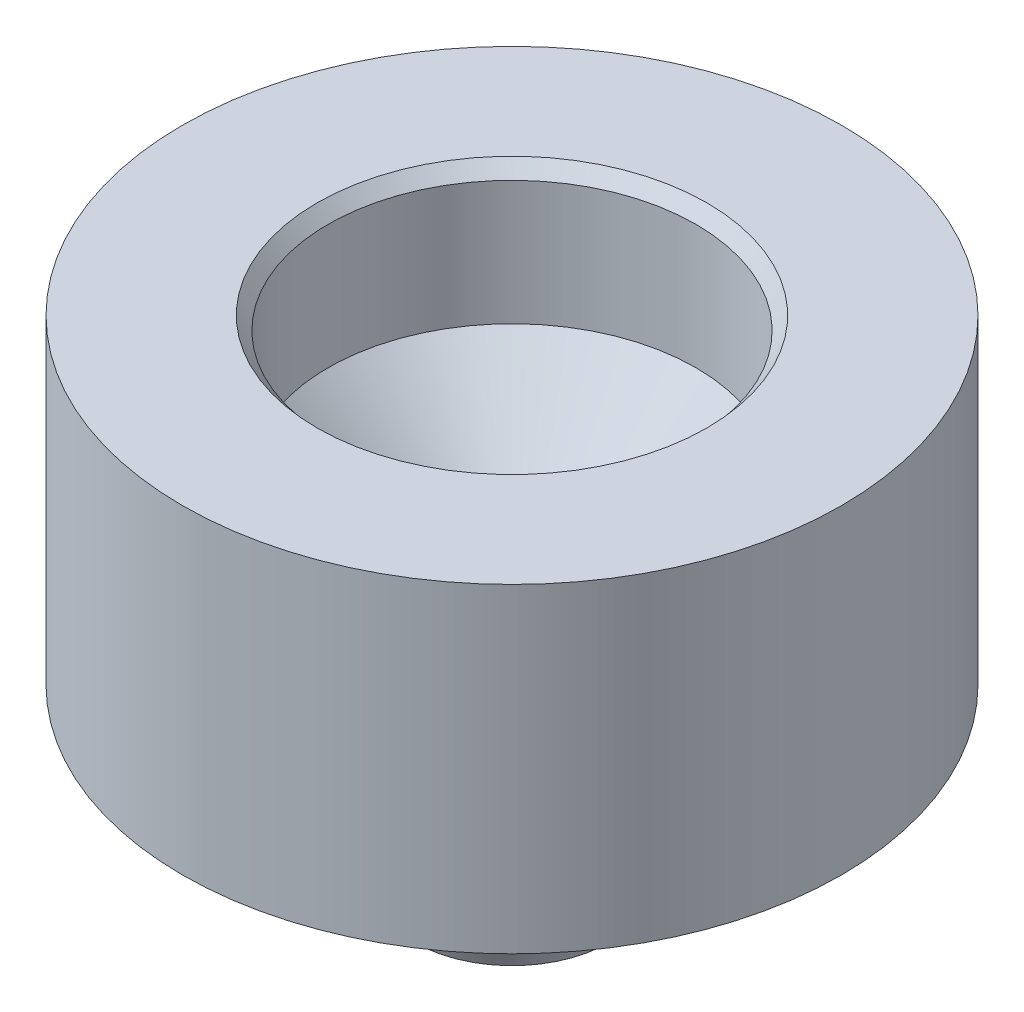
ISO-10303-21;
HEADER;
FILE_DESCRIPTION(('STEP AP214'),'2;1');
FILE_NAME('part.step','',(''),(''),'','','');
FILE_SCHEMA(('AUTOMOTIVE_DESIGN { 1 0 10303 214 1 1 1 1 }'));
ENDSEC;
DATA;
#1=APPLICATION_CONTEXT('core data for automotive mechanical design processes');
#2=APPLICATION_PROTOCOL_DEFINITION('international standard','automotive_design',2000,#1);
#3=PRODUCT_CONTEXT('',#1,'mechanical');
#4=PRODUCT('Part','Part','',(#3));
#5=PRODUCT_RELATED_PRODUCT_CATEGORY('part','',(#4));
#6=PRODUCT_DEFINITION_FORMATION('','',#4);
#7=PRODUCT_DEFINITION_CONTEXT('part definition',#1,'design');
#8=PRODUCT_DEFINITION('design','',#6,#7);
#9=PRODUCT_DEFINITION_SHAPE('','',#8);
#10=(LENGTH_UNIT() NAMED_UNIT(*) SI_UNIT(.MILLI.,.METRE.));
#11=(NAMED_UNIT(*) PLANE_ANGLE_UNIT() SI_UNIT($,.RADIAN.));
#12=(NAMED_UNIT(*) SI_UNIT($,.STERADIAN.) SOLID_ANGLE_UNIT());
#13=UNCERTAINTY_MEASURE_WITH_UNIT(LENGTH_MEASURE(1.E-05),#10,'distance_accuracy_value','');
#14=(GEOMETRIC_REPRESENTATION_CONTEXT(3) GLOBAL_UNCERTAINTY_ASSIGNED_CONTEXT((#13)) GLOBAL_UNIT_ASSIGNED_CONTEXT((#10,
#11,#12)) REPRESENTATION_CONTEXT('',''));
#15=CARTESIAN_POINT('',(0.,0.,0.));
#16=DIRECTION('',(0.,0.,1.));
#17=DIRECTION('',(1.,0.,0.));
#18=AXIS2_PLACEMENT_3D('',#15,#16,#17);
#19=CARTESIAN_POINT('',(0.,0.,0.));
#20=DIRECTION('',(0.,1.,0.));
#21=DIRECTION('',(0.,0.,1.));
#22=AXIS2_PLACEMENT_3D('',#19,#20,#21);
#23=PLANE('',#22);
#24=CARTESIAN_POINT('',(0.,0.,0.));
#25=DIRECTION('',(0.,1.,0.));
#26=DIRECTION('',(0.,0.,1.));
#27=AXIS2_PLACEMENT_3D('',#24,#25,#26);
#28=CIRCLE('',#27,3.55000000000001);
#29=CARTESIAN_POINT('',(0.,0.,3.55000000000001));
#30=VERTEX_POINT('',#29);
#31=EDGE_CURVE('E42',#30,#30,#28,.F.);
#32=ORIENTED_EDGE('',*,*,#31,.T.);
#33=EDGE_LOOP('',(#32));
#34=FACE_BOUND('',#33,.T.);
#35=ADVANCED_FACE('F31',(#34),#23,.F.);
#36=CARTESIAN_POINT('',(0.,10.,0.));
#37=DIRECTION('',(0.,1.,0.));
#38=DIRECTION('',(0.,0.,1.));
#39=AXIS2_PLACEMENT_3D('',#36,#37,#38);
#40=CYLINDRICAL_SURFACE('',#39,3.75);
#41=CARTESIAN_POINT('',(0.,0.549495483890907,0.));
#42=DIRECTION('',(0.,1.,0.));
#43=DIRECTION('',(0.,0.,1.));
#44=AXIS2_PLACEMENT_3D('',#41,#42,#43);
#45=CIRCLE('',#44,3.75);
#46=CARTESIAN_POINT('',(0.,0.549495483890907,3.75));
#47=VERTEX_POINT('',#46);
#48=EDGE_CURVE('E46',#47,#47,#45,.T.);
#49=ORIENTED_EDGE('',*,*,#48,.T.);
#50=EDGE_LOOP('',(#49));
#51=FACE_BOUND('',#50,.T.);
#52=CARTESIAN_POINT('',(0.,6.35,0.));
#53=DIRECTION('',(0.,1.,0.));
#54=DIRECTION('',(0.,0.,1.));
#55=AXIS2_PLACEMENT_3D('',#52,#53,#54);
#56=CIRCLE('',#55,3.75);
#57=CARTESIAN_POINT('',(0.,6.35,3.75));
#58=VERTEX_POINT('',#57);
#59=EDGE_CURVE('E57',#58,#58,#56,.T.);
#60=ORIENTED_EDGE('',*,*,#59,.F.);
#61=EDGE_LOOP('',(#60));
#62=FACE_BOUND('',#61,.T.);
#63=ADVANCED_FACE('F78',(#51,#62),#40,.T.);
#64=CARTESIAN_POINT('',(3.75,6.35,0.));
#65=DIRECTION('',(0.,1.,0.));
#66=DIRECTION('',(0.,0.,1.));
#67=AXIS2_PLACEMENT_3D('',#64,#65,#66);
#68=PLANE('',#67);
#69=CARTESIAN_POINT('',(0.,6.35,0.));
#70=DIRECTION('',(0.,1.,0.));
#71=DIRECTION('',(0.,0.,1.));
#72=AXIS2_PLACEMENT_3D('',#69,#70,#71);
#73=CIRCLE('',#72,12.);
#74=CARTESIAN_POINT('',(0.,6.35,12.));
#75=VERTEX_POINT('',#74);
#76=EDGE_CURVE('E60',#75,#75,#73,.T.);
#77=ORIENTED_EDGE('',*,*,#76,.F.);
#78=EDGE_LOOP('',(#77));
#79=FACE_BOUND('',#78,.T.);
#80=ORIENTED_EDGE('',*,*,#59,.T.);
#81=EDGE_LOOP('',(#80));
#82=FACE_BOUND('',#81,.T.);
#83=ADVANCED_FACE('F72',(#79,#82),#68,.F.);
#84=CARTESIAN_POINT('',(0.,10.,0.));
#85=DIRECTION('',(0.,1.,0.));
#86=DIRECTION('',(0.,0.,1.));
#87=AXIS2_PLACEMENT_3D('',#84,#85,#86);
#88=CYLINDRICAL_SURFACE('',#87,12.);
#89=CARTESIAN_POINT('',(0.,18.,0.));
#90=DIRECTION('',(0.,1.,0.));
#91=DIRECTION('',(0.,0.,1.));
#92=AXIS2_PLACEMENT_3D('',#89,#90,#91);
#93=CIRCLE('',#92,12.);
#94=CARTESIAN_POINT('',(0.,18.,12.));
#95=VERTEX_POINT('',#94);
#96=EDGE_CURVE('E63',#95,#95,#93,.T.);
#97=ORIENTED_EDGE('',*,*,#96,.F.);
#98=EDGE_LOOP('',(#97));
#99=FACE_BOUND('',#98,.T.);
#100=ORIENTED_EDGE('',*,*,#76,.T.);
#101=EDGE_LOOP('',(#100));
#102=FACE_BOUND('',#101,.T.);
#103=ADVANCED_FACE('F69',(#99,#102),#88,.T.);
#104=CARTESIAN_POINT('',(12.,18.,0.));
#105=DIRECTION('',(0.,-1.,0.));
#106=DIRECTION('',(0.,0.,-1.));
#107=AXIS2_PLACEMENT_3D('',#104,#105,#106);
#108=PLANE('',#107);
#109=CARTESIAN_POINT('',(0.,18.,0.));
#110=DIRECTION('',(0.,-1.,0.));
#111=DIRECTION('',(0.,0.,-1.));
#112=AXIS2_PLACEMENT_3D('',#109,#110,#111);
#113=CIRCLE('',#112,7.1);
#114=CARTESIAN_POINT('',(0.,18.,-7.1));
#115=VERTEX_POINT('',#114);
#116=EDGE_CURVE('E10',#115,#115,#113,.T.);
#117=ORIENTED_EDGE('',*,*,#116,.T.);
#118=EDGE_LOOP('',(#117));
#119=FACE_BOUND('',#118,.T.);
#120=ORIENTED_EDGE('',*,*,#96,.T.);
#121=EDGE_LOOP('',(#120));
#122=FACE_BOUND('',#121,.T.);
#123=ADVANCED_FACE('F67',(#119,#122),#108,.F.);
#124=CARTESIAN_POINT('',(0.,10.,0.));
#125=DIRECTION('',(0.,1.,0.));
#126=DIRECTION('',(0.,0.,1.));
#127=AXIS2_PLACEMENT_3D('',#124,#125,#126);
#128=CYLINDRICAL_SURFACE('',#127,6.7);
#129=CARTESIAN_POINT('',(0.,17.5232985629623,0.));
#130=DIRECTION('',(0.,-1.,0.));
#131=DIRECTION('',(0.,0.,-1.));
#132=AXIS2_PLACEMENT_3D('',#129,#130,#131);
#133=CIRCLE('',#132,6.7);
#134=CARTESIAN_POINT('',(0.,17.5232985629623,-6.7));
#135=VERTEX_POINT('',#134);
#136=EDGE_CURVE('E38',#135,#135,#133,.F.);
#137=ORIENTED_EDGE('',*,*,#136,.T.);
#138=EDGE_LOOP('',(#137));
#139=FACE_BOUND('',#138,.T.);
#140=CARTESIAN_POINT('',(0.,13.,0.));
#141=DIRECTION('',(0.,-1.,0.));
#142=DIRECTION('',(0.,0.,-1.));
#143=AXIS2_PLACEMENT_3D('',#140,#141,#142);
#144=CIRCLE('',#143,6.7);
#145=CARTESIAN_POINT('',(0.,13.,-6.7));
#146=VERTEX_POINT('',#145);
#147=EDGE_CURVE('E51',#146,#146,#144,.T.);
#148=ORIENTED_EDGE('',*,*,#147,.T.);
#149=EDGE_LOOP('',(#148));
#150=FACE_BOUND('',#149,.T.);
#151=ADVANCED_FACE('F114',(#139,#150),#128,.F.);
#152=CARTESIAN_POINT('',(6.7,10.,0.));
#153=DIRECTION('',(0.,-1.,0.));
#154=DIRECTION('',(0.,0.,-1.));
#155=AXIS2_PLACEMENT_3D('',#152,#153,#154);
#156=PLANE('',#155);
#157=CARTESIAN_POINT('',(0.,10.,0.));
#158=DIRECTION('',(0.,-1.,0.));
#159=DIRECTION('',(0.,0.,-1.));
#160=AXIS2_PLACEMENT_3D('',#157,#158,#159);
#161=CIRCLE('',#160,3.70000000000001);
#162=CARTESIAN_POINT('',(0.,10.,-3.70000000000001));
#163=VERTEX_POINT('',#162);
#164=EDGE_CURVE('E54',#163,#163,#161,.F.);
#165=ORIENTED_EDGE('',*,*,#164,.T.);
#166=EDGE_LOOP('',(#165));
#167=FACE_BOUND('',#166,.T.);
#168=ADVANCED_FACE('F94',(#167),#156,.F.);
#169=CARTESIAN_POINT('',(0.,10.,0.));
#170=DIRECTION('',(0.,1.,0.));
#171=DIRECTION('',(0.,0.,1.));
#172=AXIS2_PLACEMENT_3D('',#169,#170,#171);
#173=CONICAL_SURFACE('',#172,3.70000000000001,0.785398163397449);
#174=ORIENTED_EDGE('',*,*,#147,.F.);
#175=EDGE_LOOP('',(#174));
#176=FACE_BOUND('',#175,.T.);
#177=ORIENTED_EDGE('',*,*,#164,.F.);
#178=EDGE_LOOP('',(#177));
#179=FACE_BOUND('',#178,.T.);
#180=ADVANCED_FACE('F91',(#176,#179),#173,.F.);
#181=CARTESIAN_POINT('',(0.,0.549495483890907,0.));
#182=DIRECTION('',(0.,1.,0.));
#183=DIRECTION('',(0.,0.,1.));
#184=AXIS2_PLACEMENT_3D('',#181,#182,#183);
#185=CONICAL_SURFACE('',#184,3.75,0.349065850398863);
#186=ORIENTED_EDGE('',*,*,#31,.F.);
#187=EDGE_LOOP('',(#186));
#188=FACE_BOUND('',#187,.T.);
#189=ORIENTED_EDGE('',*,*,#48,.F.);
#190=EDGE_LOOP('',(#189));
#191=FACE_BOUND('',#190,.T.);
#192=ADVANCED_FACE('F93',(#188,#191),#185,.T.);
#193=CARTESIAN_POINT('',(0.,17.5232985629623,0.));
#194=DIRECTION('',(0.,1.,0.));
#195=DIRECTION('',(0.,0.,1.));
#196=AXIS2_PLACEMENT_3D('',#193,#194,#195);
#197=CONICAL_SURFACE('',#196,6.7,0.698131700797728);
#198=ORIENTED_EDGE('',*,*,#116,.F.);
#199=EDGE_LOOP('',(#198));
#200=FACE_BOUND('',#199,.T.);
#201=ORIENTED_EDGE('',*,*,#136,.F.);
#202=EDGE_LOOP('',(#201));
#203=FACE_BOUND('',#202,.T.);
#204=ADVANCED_FACE('F33',(#200,#203),#197,.F.);
#205=CLOSED_SHELL('',(#35,#63,#83,#103,#123,#151,#168,#180,#192,#204));
#206=MANIFOLD_SOLID_BREP('B2',#205);
#207=ADVANCED_BREP_SHAPE_REPRESENTATION('',(#18,#206),#14);
#208=SHAPE_DEFINITION_REPRESENTATION(#9,#207);
ENDSEC;
END-ISO-10303-21;
